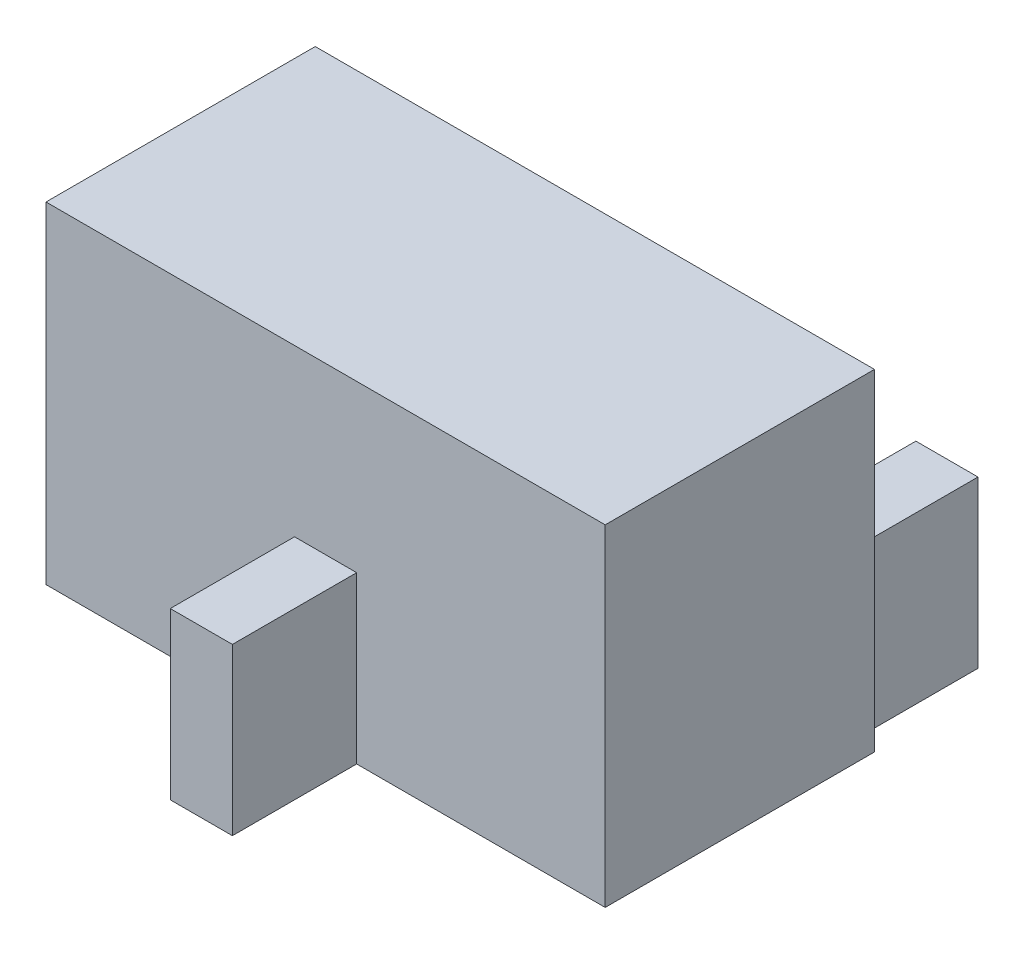
ISO-10303-21;
HEADER;
FILE_DESCRIPTION(('STEP AP214'),'2;1');
FILE_NAME('part.step','',(''),(''),'','','');
FILE_SCHEMA(('AUTOMOTIVE_DESIGN { 1 0 10303 214 1 1 1 1 }'));
ENDSEC;
DATA;
#1=APPLICATION_CONTEXT('core data for automotive mechanical design processes');
#2=APPLICATION_PROTOCOL_DEFINITION('international standard','automotive_design',2000,#1);
#3=PRODUCT_CONTEXT('',#1,'mechanical');
#4=PRODUCT('Part','Part','',(#3));
#5=PRODUCT_RELATED_PRODUCT_CATEGORY('part','',(#4));
#6=PRODUCT_DEFINITION_FORMATION('','',#4);
#7=PRODUCT_DEFINITION_CONTEXT('part definition',#1,'design');
#8=PRODUCT_DEFINITION('design','',#6,#7);
#9=PRODUCT_DEFINITION_SHAPE('','',#8);
#10=(LENGTH_UNIT() NAMED_UNIT(*) SI_UNIT(.MILLI.,.METRE.));
#11=(NAMED_UNIT(*) PLANE_ANGLE_UNIT() SI_UNIT($,.RADIAN.));
#12=(NAMED_UNIT(*) SI_UNIT($,.STERADIAN.) SOLID_ANGLE_UNIT());
#13=UNCERTAINTY_MEASURE_WITH_UNIT(LENGTH_MEASURE(1.E-05),#10,'distance_accuracy_value','');
#14=(GEOMETRIC_REPRESENTATION_CONTEXT(3) GLOBAL_UNCERTAINTY_ASSIGNED_CONTEXT((#13)) GLOBAL_UNIT_ASSIGNED_CONTEXT((#10,
#11,#12)) REPRESENTATION_CONTEXT('',''));
#15=CARTESIAN_POINT('',(0.,0.,0.));
#16=DIRECTION('',(0.,0.,1.));
#17=DIRECTION('',(1.,0.,0.));
#18=AXIS2_PLACEMENT_3D('',#15,#16,#17);
#19=CARTESIAN_POINT('',(-1.81283783783784,1.6,0.816891891891892));
#20=DIRECTION('',(0.,0.,-1.));
#21=DIRECTION('',(-1.,0.,0.));
#22=AXIS2_PLACEMENT_3D('',#19,#20,#21);
#23=PLANE('',#22);
#24=DIRECTION('',(0.,-1.,0.));
#25=VECTOR('',#24,1.);
#26=CARTESIAN_POINT('',(-0.612837837837838,0.8,0.816891891891892));
#27=LINE('',#26,#25);
#28=CARTESIAN_POINT('',(-0.612837837837838,0.8,0.816891891891892));
#29=VERTEX_POINT('',#28);
#30=CARTESIAN_POINT('',(-0.612837837837838,0.,0.816891891891892));
#31=VERTEX_POINT('',#30);
#32=EDGE_CURVE('E317',#29,#31,#27,.T.);
#33=ORIENTED_EDGE('',*,*,#32,.F.);
#34=DIRECTION('',(-1.,0.,0.));
#35=VECTOR('',#34,1.);
#36=CARTESIAN_POINT('',(-0.312837837837838,0.8,0.816891891891892));
#37=LINE('',#36,#35);
#38=CARTESIAN_POINT('',(-0.312837837837838,0.8,0.816891891891892));
#39=VERTEX_POINT('',#38);
#40=EDGE_CURVE('E171',#39,#29,#37,.T.);
#41=ORIENTED_EDGE('',*,*,#40,.F.);
#42=DIRECTION('',(0.,-1.,0.));
#43=VECTOR('',#42,1.);
#44=CARTESIAN_POINT('',(-0.312837837837838,0.8,0.816891891891892));
#45=LINE('',#44,#43);
#46=CARTESIAN_POINT('',(-0.312837837837838,0.,0.816891891891892));
#47=VERTEX_POINT('',#46);
#48=EDGE_CURVE('E183',#39,#47,#45,.T.);
#49=ORIENTED_EDGE('',*,*,#48,.T.);
#50=DIRECTION('',(1.,0.,0.));
#51=VECTOR('',#50,1.);
#52=CARTESIAN_POINT('',(-1.81283783783784,0.,0.816891891891892));
#53=LINE('',#52,#51);
#54=CARTESIAN_POINT('',(0.887162162162162,0.,0.816891891891892));
#55=VERTEX_POINT('',#54);
#56=EDGE_CURVE('E250',#47,#55,#53,.T.);
#57=ORIENTED_EDGE('',*,*,#56,.T.);
#58=DIRECTION('',(0.,-1.,0.));
#59=VECTOR('',#58,1.);
#60=CARTESIAN_POINT('',(0.887162162162162,1.6,0.816891891891892));
#61=LINE('',#60,#59);
#62=CARTESIAN_POINT('',(0.887162162162162,1.6,0.816891891891892));
#63=VERTEX_POINT('',#62);
#64=EDGE_CURVE('E48',#63,#55,#61,.T.);
#65=ORIENTED_EDGE('',*,*,#64,.F.);
#66=DIRECTION('',(1.,0.,0.));
#67=VECTOR('',#66,1.);
#68=CARTESIAN_POINT('',(-1.81283783783784,1.6,0.816891891891892));
#69=LINE('',#68,#67);
#70=CARTESIAN_POINT('',(-1.81283783783784,1.6,0.816891891891892));
#71=VERTEX_POINT('',#70);
#72=EDGE_CURVE('E240',#71,#63,#69,.T.);
#73=ORIENTED_EDGE('',*,*,#72,.F.);
#74=DIRECTION('',(0.,-1.,0.));
#75=VECTOR('',#74,1.);
#76=CARTESIAN_POINT('',(-1.81283783783784,1.6,0.816891891891892));
#77=LINE('',#76,#75);
#78=CARTESIAN_POINT('',(-1.81283783783784,0.,0.816891891891892));
#79=VERTEX_POINT('',#78);
#80=EDGE_CURVE('E11',#71,#79,#77,.T.);
#81=ORIENTED_EDGE('',*,*,#80,.T.);
#82=EDGE_CURVE('E251',#79,#31,#53,.T.);
#83=ORIENTED_EDGE('',*,*,#82,.T.);
#84=EDGE_LOOP('',(#33,#41,#49,#57,#65,#73,#81,#83));
#85=FACE_BOUND('',#84,.T.);
#86=ADVANCED_FACE('F40',(#85),#23,.F.);
#87=CARTESIAN_POINT('',(-1.81283783783784,1.6,-0.483108108108108));
#88=DIRECTION('',(0.,0.,1.));
#89=DIRECTION('',(1.,0.,0.));
#90=AXIS2_PLACEMENT_3D('',#87,#88,#89);
#91=PLANE('',#90);
#92=DIRECTION('',(0.,-1.,0.));
#93=VECTOR('',#92,1.);
#94=CARTESIAN_POINT('',(0.787162162162162,0.8,-0.483108108108108));
#95=LINE('',#94,#93);
#96=CARTESIAN_POINT('',(0.787162162162162,0.8,-0.483108108108108));
#97=VERTEX_POINT('',#96);
#98=CARTESIAN_POINT('',(0.787162162162161,0.,-0.483108108108108));
#99=VERTEX_POINT('',#98);
#100=EDGE_CURVE('E195',#97,#99,#95,.T.);
#101=ORIENTED_EDGE('',*,*,#100,.F.);
#102=DIRECTION('',(1.,0.,0.));
#103=VECTOR('',#102,1.);
#104=CARTESIAN_POINT('',(0.787162162162162,0.8,-0.483108108108108));
#105=LINE('',#104,#103);
#106=CARTESIAN_POINT('',(0.487162162162162,0.8,-0.483108108108108));
#107=VERTEX_POINT('',#106);
#108=EDGE_CURVE('E63',#107,#97,#105,.T.);
#109=ORIENTED_EDGE('',*,*,#108,.F.);
#110=DIRECTION('',(0.,-1.,0.));
#111=VECTOR('',#110,1.);
#112=CARTESIAN_POINT('',(0.487162162162162,0.8,-0.483108108108108));
#113=LINE('',#112,#111);
#114=CARTESIAN_POINT('',(0.487162162162162,0.,-0.483108108108108));
#115=VERTEX_POINT('',#114);
#116=EDGE_CURVE('E202',#107,#115,#113,.T.);
#117=ORIENTED_EDGE('',*,*,#116,.T.);
#118=DIRECTION('',(-1.,0.,0.));
#119=VECTOR('',#118,1.);
#120=CARTESIAN_POINT('',(-1.81283783783784,0.,-0.483108108108108));
#121=LINE('',#120,#119);
#122=CARTESIAN_POINT('',(-1.41283783783784,0.,-0.483108108108108));
#123=VERTEX_POINT('',#122);
#124=EDGE_CURVE('E258',#115,#123,#121,.T.);
#125=ORIENTED_EDGE('',*,*,#124,.T.);
#126=DIRECTION('',(0.,-1.,0.));
#127=VECTOR('',#126,1.);
#128=CARTESIAN_POINT('',(-1.41283783783784,0.8,-0.483108108108108));
#129=LINE('',#128,#127);
#130=CARTESIAN_POINT('',(-1.41283783783784,0.8,-0.483108108108108));
#131=VERTEX_POINT('',#130);
#132=EDGE_CURVE('E230',#131,#123,#129,.T.);
#133=ORIENTED_EDGE('',*,*,#132,.F.);
#134=DIRECTION('',(1.,0.,0.));
#135=VECTOR('',#134,1.);
#136=CARTESIAN_POINT('',(-1.71283783783784,0.8,-0.483108108108108));
#137=LINE('',#136,#135);
#138=CARTESIAN_POINT('',(-1.71283783783784,0.8,-0.483108108108108));
#139=VERTEX_POINT('',#138);
#140=EDGE_CURVE('E213',#139,#131,#137,.T.);
#141=ORIENTED_EDGE('',*,*,#140,.F.);
#142=DIRECTION('',(0.,-1.,0.));
#143=VECTOR('',#142,1.);
#144=CARTESIAN_POINT('',(-1.71283783783784,0.8,-0.483108108108108));
#145=LINE('',#144,#143);
#146=CARTESIAN_POINT('',(-1.71283783783784,0.,-0.483108108108108));
#147=VERTEX_POINT('',#146);
#148=EDGE_CURVE('E233',#139,#147,#145,.T.);
#149=ORIENTED_EDGE('',*,*,#148,.T.);
#150=CARTESIAN_POINT('',(-1.81283783783784,0.,-0.483108108108108));
#151=VERTEX_POINT('',#150);
#152=EDGE_CURVE('E256',#147,#151,#121,.T.);
#153=ORIENTED_EDGE('',*,*,#152,.T.);
#154=DIRECTION('',(0.,-1.,0.));
#155=VECTOR('',#154,1.);
#156=CARTESIAN_POINT('',(-1.81283783783784,1.6,-0.483108108108108));
#157=LINE('',#156,#155);
#158=CARTESIAN_POINT('',(-1.81283783783784,1.6,-0.483108108108108));
#159=VERTEX_POINT('',#158);
#160=EDGE_CURVE('E247',#159,#151,#157,.T.);
#161=ORIENTED_EDGE('',*,*,#160,.F.);
#162=DIRECTION('',(-1.,0.,0.));
#163=VECTOR('',#162,1.);
#164=CARTESIAN_POINT('',(-1.81283783783784,1.6,-0.483108108108108));
#165=LINE('',#164,#163);
#166=CARTESIAN_POINT('',(0.887162162162162,1.6,-0.483108108108108));
#167=VERTEX_POINT('',#166);
#168=EDGE_CURVE('E245',#167,#159,#165,.T.);
#169=ORIENTED_EDGE('',*,*,#168,.F.);
#170=DIRECTION('',(0.,-1.,0.));
#171=VECTOR('',#170,1.);
#172=CARTESIAN_POINT('',(0.887162162162162,1.6,-0.483108108108108));
#173=LINE('',#172,#171);
#174=CARTESIAN_POINT('',(0.887162162162162,0.,-0.483108108108108));
#175=VERTEX_POINT('',#174);
#176=EDGE_CURVE('E261',#167,#175,#173,.T.);
#177=ORIENTED_EDGE('',*,*,#176,.T.);
#178=EDGE_CURVE('E241',#175,#99,#121,.T.);
#179=ORIENTED_EDGE('',*,*,#178,.T.);
#180=EDGE_LOOP('',(#101,#109,#117,#125,#133,#141,#149,#153,#161,#169,#177,#179));
#181=FACE_BOUND('',#180,.T.);
#182=ADVANCED_FACE('F277',(#181),#91,.F.);
#183=CARTESIAN_POINT('',(-1.81283783783784,1.6,-0.483108108108108));
#184=DIRECTION('',(1.,0.,0.));
#185=DIRECTION('',(0.,0.,-1.));
#186=AXIS2_PLACEMENT_3D('',#183,#184,#185);
#187=PLANE('',#186);
#188=DIRECTION('',(0.,0.,1.));
#189=VECTOR('',#188,1.);
#190=CARTESIAN_POINT('',(-1.81283783783784,0.,-0.483108108108108));
#191=LINE('',#190,#189);
#192=EDGE_CURVE('E236',#151,#79,#191,.T.);
#193=ORIENTED_EDGE('',*,*,#192,.T.);
#194=ORIENTED_EDGE('',*,*,#80,.F.);
#195=DIRECTION('',(0.,0.,1.));
#196=VECTOR('',#195,1.);
#197=CARTESIAN_POINT('',(-1.81283783783784,1.6,-0.483108108108108));
#198=LINE('',#197,#196);
#199=EDGE_CURVE('E237',#159,#71,#198,.T.);
#200=ORIENTED_EDGE('',*,*,#199,.F.);
#201=ORIENTED_EDGE('',*,*,#160,.T.);
#202=EDGE_LOOP('',(#193,#194,#200,#201));
#203=FACE_BOUND('',#202,.T.);
#204=ADVANCED_FACE('F42',(#203),#187,.F.);
#205=CARTESIAN_POINT('',(0.887162162162162,1.6,-0.483108108108108));
#206=DIRECTION('',(-1.,0.,0.));
#207=DIRECTION('',(0.,0.,1.));
#208=AXIS2_PLACEMENT_3D('',#205,#206,#207);
#209=PLANE('',#208);
#210=DIRECTION('',(0.,0.,-1.));
#211=VECTOR('',#210,1.);
#212=CARTESIAN_POINT('',(0.887162162162162,0.,-0.483108108108108));
#213=LINE('',#212,#211);
#214=EDGE_CURVE('E254',#55,#175,#213,.T.);
#215=ORIENTED_EDGE('',*,*,#214,.T.);
#216=ORIENTED_EDGE('',*,*,#176,.F.);
#217=DIRECTION('',(0.,0.,-1.));
#218=VECTOR('',#217,1.);
#219=CARTESIAN_POINT('',(0.887162162162162,1.6,-0.483108108108108));
#220=LINE('',#219,#218);
#221=EDGE_CURVE('E243',#63,#167,#220,.T.);
#222=ORIENTED_EDGE('',*,*,#221,.F.);
#223=ORIENTED_EDGE('',*,*,#64,.T.);
#224=EDGE_LOOP('',(#215,#216,#222,#223));
#225=FACE_BOUND('',#224,.T.);
#226=ADVANCED_FACE('F268',(#225),#209,.F.);
#227=CARTESIAN_POINT('',(0.,1.6,0.));
#228=DIRECTION('',(0.,1.,0.));
#229=DIRECTION('',(0.,0.,1.));
#230=AXIS2_PLACEMENT_3D('',#227,#228,#229);
#231=PLANE('',#230);
#232=ORIENTED_EDGE('',*,*,#199,.T.);
#233=ORIENTED_EDGE('',*,*,#72,.T.);
#234=ORIENTED_EDGE('',*,*,#221,.T.);
#235=ORIENTED_EDGE('',*,*,#168,.T.);
#236=EDGE_LOOP('',(#232,#233,#234,#235));
#237=FACE_BOUND('',#236,.T.);
#238=ADVANCED_FACE('F316',(#237),#231,.T.);
#239=CARTESIAN_POINT('',(0.,0.,0.));
#240=DIRECTION('',(0.,1.,0.));
#241=DIRECTION('',(0.,0.,1.));
#242=AXIS2_PLACEMENT_3D('',#239,#240,#241);
#243=PLANE('',#242);
#244=ORIENTED_EDGE('',*,*,#192,.F.);
#245=ORIENTED_EDGE('',*,*,#152,.F.);
#246=DIRECTION('',(0.,0.,1.));
#247=VECTOR('',#246,1.);
#248=CARTESIAN_POINT('',(-1.71283783783784,0.,-0.483108108108108));
#249=LINE('',#248,#247);
#250=CARTESIAN_POINT('',(-1.71283783783784,0.,-1.08310810810811));
#251=VERTEX_POINT('',#250);
#252=EDGE_CURVE('E210',#251,#147,#249,.T.);
#253=ORIENTED_EDGE('',*,*,#252,.F.);
#254=DIRECTION('',(-1.,0.,0.));
#255=VECTOR('',#254,1.);
#256=CARTESIAN_POINT('',(-1.71283783783784,0.,-1.08310810810811));
#257=LINE('',#256,#255);
#258=CARTESIAN_POINT('',(-1.41283783783784,0.,-1.08310810810811));
#259=VERTEX_POINT('',#258);
#260=EDGE_CURVE('E214',#259,#251,#257,.T.);
#261=ORIENTED_EDGE('',*,*,#260,.F.);
#262=DIRECTION('',(0.,0.,-1.));
#263=VECTOR('',#262,1.);
#264=CARTESIAN_POINT('',(-1.41283783783784,0.,-0.483108108108108));
#265=LINE('',#264,#263);
#266=EDGE_CURVE('E222',#123,#259,#265,.T.);
#267=ORIENTED_EDGE('',*,*,#266,.F.);
#268=ORIENTED_EDGE('',*,*,#124,.F.);
#269=DIRECTION('',(0.,0.,1.));
#270=VECTOR('',#269,1.);
#271=CARTESIAN_POINT('',(0.487162162162162,0.,-0.483108108108108));
#272=LINE('',#271,#270);
#273=CARTESIAN_POINT('',(0.487162162162162,0.,-1.08310810810811));
#274=VERTEX_POINT('',#273);
#275=EDGE_CURVE('E191',#274,#115,#272,.T.);
#276=ORIENTED_EDGE('',*,*,#275,.F.);
#277=DIRECTION('',(-1.,0.,0.));
#278=VECTOR('',#277,1.);
#279=CARTESIAN_POINT('',(0.787162162162162,0.,-1.08310810810811));
#280=LINE('',#279,#278);
#281=CARTESIAN_POINT('',(0.787162162162162,0.,-1.08310810810811));
#282=VERTEX_POINT('',#281);
#283=EDGE_CURVE('E181',#282,#274,#280,.T.);
#284=ORIENTED_EDGE('',*,*,#283,.F.);
#285=DIRECTION('',(0.,0.,-1.));
#286=VECTOR('',#285,1.);
#287=CARTESIAN_POINT('',(0.787162162162162,0.,-0.483108108108108));
#288=LINE('',#287,#286);
#289=EDGE_CURVE('E178',#99,#282,#288,.T.);
#290=ORIENTED_EDGE('',*,*,#289,.F.);
#291=ORIENTED_EDGE('',*,*,#178,.F.);
#292=ORIENTED_EDGE('',*,*,#214,.F.);
#293=ORIENTED_EDGE('',*,*,#56,.F.);
#294=DIRECTION('',(0.,0.,-1.));
#295=VECTOR('',#294,1.);
#296=CARTESIAN_POINT('',(-0.312837837837838,0.,1.41689189189189));
#297=LINE('',#296,#295);
#298=CARTESIAN_POINT('',(-0.312837837837838,0.,1.41689189189189));
#299=VERTEX_POINT('',#298);
#300=EDGE_CURVE('E55',#299,#47,#297,.T.);
#301=ORIENTED_EDGE('',*,*,#300,.F.);
#302=DIRECTION('',(1.,0.,0.));
#303=VECTOR('',#302,1.);
#304=CARTESIAN_POINT('',(-0.312837837837838,0.,1.41689189189189));
#305=LINE('',#304,#303);
#306=CARTESIAN_POINT('',(-0.612837837837838,0.,1.41689189189189));
#307=VERTEX_POINT('',#306);
#308=EDGE_CURVE('E322',#307,#299,#305,.T.);
#309=ORIENTED_EDGE('',*,*,#308,.F.);
#310=DIRECTION('',(0.,0.,1.));
#311=VECTOR('',#310,1.);
#312=CARTESIAN_POINT('',(-0.612837837837838,0.,1.41689189189189));
#313=LINE('',#312,#311);
#314=EDGE_CURVE('E177',#31,#307,#313,.T.);
#315=ORIENTED_EDGE('',*,*,#314,.F.);
#316=ORIENTED_EDGE('',*,*,#82,.F.);
#317=EDGE_LOOP('',(#244,#245,#253,#261,#267,#268,#276,#284,#290,#291,#292,#293,#301,#309,#315,#316));
#318=FACE_BOUND('',#317,.T.);
#319=ADVANCED_FACE('F275',(#318),#243,.F.);
#320=CARTESIAN_POINT('',(-1.71283783783784,0.8,-0.483108108108108));
#321=DIRECTION('',(1.,0.,0.));
#322=DIRECTION('',(0.,0.,-1.));
#323=AXIS2_PLACEMENT_3D('',#320,#321,#322);
#324=PLANE('',#323);
#325=ORIENTED_EDGE('',*,*,#252,.T.);
#326=ORIENTED_EDGE('',*,*,#148,.F.);
#327=DIRECTION('',(0.,0.,1.));
#328=VECTOR('',#327,1.);
#329=CARTESIAN_POINT('',(-1.71283783783784,0.8,-0.483108108108108));
#330=LINE('',#329,#328);
#331=CARTESIAN_POINT('',(-1.71283783783784,0.8,-1.08310810810811));
#332=VERTEX_POINT('',#331);
#333=EDGE_CURVE('E211',#332,#139,#330,.T.);
#334=ORIENTED_EDGE('',*,*,#333,.F.);
#335=DIRECTION('',(0.,-1.,0.));
#336=VECTOR('',#335,1.);
#337=CARTESIAN_POINT('',(-1.71283783783784,0.8,-1.08310810810811));
#338=LINE('',#337,#336);
#339=EDGE_CURVE('E220',#332,#251,#338,.T.);
#340=ORIENTED_EDGE('',*,*,#339,.T.);
#341=EDGE_LOOP('',(#325,#326,#334,#340));
#342=FACE_BOUND('',#341,.T.);
#343=ADVANCED_FACE('F307',(#342),#324,.F.);
#344=CARTESIAN_POINT('',(-1.41283783783784,0.8,-0.483108108108108));
#345=DIRECTION('',(-1.,0.,0.));
#346=DIRECTION('',(0.,0.,1.));
#347=AXIS2_PLACEMENT_3D('',#344,#345,#346);
#348=PLANE('',#347);
#349=ORIENTED_EDGE('',*,*,#266,.T.);
#350=DIRECTION('',(0.,-1.,0.));
#351=VECTOR('',#350,1.);
#352=CARTESIAN_POINT('',(-1.41283783783784,0.8,-1.08310810810811));
#353=LINE('',#352,#351);
#354=CARTESIAN_POINT('',(-1.41283783783784,0.8,-1.08310810810811));
#355=VERTEX_POINT('',#354);
#356=EDGE_CURVE('E227',#355,#259,#353,.T.);
#357=ORIENTED_EDGE('',*,*,#356,.F.);
#358=DIRECTION('',(0.,0.,-1.));
#359=VECTOR('',#358,1.);
#360=CARTESIAN_POINT('',(-1.41283783783784,0.8,-0.483108108108108));
#361=LINE('',#360,#359);
#362=EDGE_CURVE('E216',#131,#355,#361,.T.);
#363=ORIENTED_EDGE('',*,*,#362,.F.);
#364=ORIENTED_EDGE('',*,*,#132,.T.);
#365=EDGE_LOOP('',(#349,#357,#363,#364));
#366=FACE_BOUND('',#365,.T.);
#367=ADVANCED_FACE('F296',(#366),#348,.F.);
#368=CARTESIAN_POINT('',(-1.71283783783784,0.8,-1.08310810810811));
#369=DIRECTION('',(0.,0.,1.));
#370=DIRECTION('',(1.,0.,0.));
#371=AXIS2_PLACEMENT_3D('',#368,#369,#370);
#372=PLANE('',#371);
#373=ORIENTED_EDGE('',*,*,#260,.T.);
#374=ORIENTED_EDGE('',*,*,#339,.F.);
#375=DIRECTION('',(-1.,0.,0.));
#376=VECTOR('',#375,1.);
#377=CARTESIAN_POINT('',(-1.71283783783784,0.8,-1.08310810810811));
#378=LINE('',#377,#376);
#379=EDGE_CURVE('E218',#355,#332,#378,.T.);
#380=ORIENTED_EDGE('',*,*,#379,.F.);
#381=ORIENTED_EDGE('',*,*,#356,.T.);
#382=EDGE_LOOP('',(#373,#374,#380,#381));
#383=FACE_BOUND('',#382,.T.);
#384=ADVANCED_FACE('F303',(#383),#372,.F.);
#385=CARTESIAN_POINT('',(0.,0.8,0.));
#386=DIRECTION('',(0.,-1.,0.));
#387=DIRECTION('',(0.,0.,-1.));
#388=AXIS2_PLACEMENT_3D('',#385,#386,#387);
#389=PLANE('',#388);
#390=ORIENTED_EDGE('',*,*,#333,.T.);
#391=ORIENTED_EDGE('',*,*,#140,.T.);
#392=ORIENTED_EDGE('',*,*,#362,.T.);
#393=ORIENTED_EDGE('',*,*,#379,.T.);
#394=EDGE_LOOP('',(#390,#391,#392,#393));
#395=FACE_BOUND('',#394,.T.);
#396=ADVANCED_FACE('F310',(#395),#389,.F.);
#397=CARTESIAN_POINT('',(0.787162162162162,0.8,-0.483108108108108));
#398=DIRECTION('',(-1.,0.,0.));
#399=DIRECTION('',(0.,0.,1.));
#400=AXIS2_PLACEMENT_3D('',#397,#398,#399);
#401=PLANE('',#400);
#402=ORIENTED_EDGE('',*,*,#289,.T.);
#403=DIRECTION('',(0.,-1.,0.));
#404=VECTOR('',#403,1.);
#405=CARTESIAN_POINT('',(0.787162162162162,0.8,-1.08310810810811));
#406=LINE('',#405,#404);
#407=CARTESIAN_POINT('',(0.787162162162162,0.8,-1.08310810810811));
#408=VERTEX_POINT('',#407);
#409=EDGE_CURVE('E207',#408,#282,#406,.T.);
#410=ORIENTED_EDGE('',*,*,#409,.F.);
#411=DIRECTION('',(0.,0.,-1.));
#412=VECTOR('',#411,1.);
#413=CARTESIAN_POINT('',(0.787162162162162,0.8,-0.483108108108108));
#414=LINE('',#413,#412);
#415=EDGE_CURVE('E187',#97,#408,#414,.T.);
#416=ORIENTED_EDGE('',*,*,#415,.F.);
#417=ORIENTED_EDGE('',*,*,#100,.T.);
#418=EDGE_LOOP('',(#402,#410,#416,#417));
#419=FACE_BOUND('',#418,.T.);
#420=ADVANCED_FACE('F281',(#419),#401,.F.);
#421=CARTESIAN_POINT('',(0.787162162162162,0.8,-1.08310810810811));
#422=DIRECTION('',(0.,0.,1.));
#423=DIRECTION('',(1.,0.,0.));
#424=AXIS2_PLACEMENT_3D('',#421,#422,#423);
#425=PLANE('',#424);
#426=ORIENTED_EDGE('',*,*,#283,.T.);
#427=DIRECTION('',(0.,-1.,0.));
#428=VECTOR('',#427,1.);
#429=CARTESIAN_POINT('',(0.487162162162162,0.8,-1.08310810810811));
#430=LINE('',#429,#428);
#431=CARTESIAN_POINT('',(0.487162162162162,0.8,-1.08310810810811));
#432=VERTEX_POINT('',#431);
#433=EDGE_CURVE('E204',#432,#274,#430,.T.);
#434=ORIENTED_EDGE('',*,*,#433,.F.);
#435=DIRECTION('',(-1.,0.,0.));
#436=VECTOR('',#435,1.);
#437=CARTESIAN_POINT('',(0.787162162162162,0.8,-1.08310810810811));
#438=LINE('',#437,#436);
#439=EDGE_CURVE('E190',#408,#432,#438,.T.);
#440=ORIENTED_EDGE('',*,*,#439,.F.);
#441=ORIENTED_EDGE('',*,*,#409,.T.);
#442=EDGE_LOOP('',(#426,#434,#440,#441));
#443=FACE_BOUND('',#442,.T.);
#444=ADVANCED_FACE('F356',(#443),#425,.F.);
#445=CARTESIAN_POINT('',(0.487162162162162,0.8,-0.483108108108108));
#446=DIRECTION('',(1.,0.,0.));
#447=DIRECTION('',(0.,0.,-1.));
#448=AXIS2_PLACEMENT_3D('',#445,#446,#447);
#449=PLANE('',#448);
#450=ORIENTED_EDGE('',*,*,#275,.T.);
#451=ORIENTED_EDGE('',*,*,#116,.F.);
#452=DIRECTION('',(0.,0.,1.));
#453=VECTOR('',#452,1.);
#454=CARTESIAN_POINT('',(0.487162162162162,0.8,-0.483108108108108));
#455=LINE('',#454,#453);
#456=EDGE_CURVE('E193',#432,#107,#455,.T.);
#457=ORIENTED_EDGE('',*,*,#456,.F.);
#458=ORIENTED_EDGE('',*,*,#433,.T.);
#459=EDGE_LOOP('',(#450,#451,#457,#458));
#460=FACE_BOUND('',#459,.T.);
#461=ADVANCED_FACE('F289',(#460),#449,.F.);
#462=CARTESIAN_POINT('',(0.,0.8,0.));
#463=DIRECTION('',(0.,1.,0.));
#464=DIRECTION('',(0.,0.,1.));
#465=AXIS2_PLACEMENT_3D('',#462,#463,#464);
#466=PLANE('',#465);
#467=ORIENTED_EDGE('',*,*,#415,.T.);
#468=ORIENTED_EDGE('',*,*,#439,.T.);
#469=ORIENTED_EDGE('',*,*,#456,.T.);
#470=ORIENTED_EDGE('',*,*,#108,.T.);
#471=EDGE_LOOP('',(#467,#468,#469,#470));
#472=FACE_BOUND('',#471,.T.);
#473=ADVANCED_FACE('F284',(#472),#466,.T.);
#474=CARTESIAN_POINT('',(-0.612837837837838,0.8,1.41689189189189));
#475=DIRECTION('',(1.,0.,0.));
#476=DIRECTION('',(0.,0.,-1.));
#477=AXIS2_PLACEMENT_3D('',#474,#475,#476);
#478=PLANE('',#477);
#479=ORIENTED_EDGE('',*,*,#314,.T.);
#480=DIRECTION('',(0.,-1.,0.));
#481=VECTOR('',#480,1.);
#482=CARTESIAN_POINT('',(-0.612837837837838,0.8,1.41689189189189));
#483=LINE('',#482,#481);
#484=CARTESIAN_POINT('',(-0.612837837837838,0.8,1.41689189189189));
#485=VERTEX_POINT('',#484);
#486=EDGE_CURVE('E160',#485,#307,#483,.T.);
#487=ORIENTED_EDGE('',*,*,#486,.F.);
#488=DIRECTION('',(0.,0.,1.));
#489=VECTOR('',#488,1.);
#490=CARTESIAN_POINT('',(-0.612837837837838,0.8,1.41689189189189));
#491=LINE('',#490,#489);
#492=EDGE_CURVE('E166',#29,#485,#491,.T.);
#493=ORIENTED_EDGE('',*,*,#492,.F.);
#494=ORIENTED_EDGE('',*,*,#32,.T.);
#495=EDGE_LOOP('',(#479,#487,#493,#494));
#496=FACE_BOUND('',#495,.T.);
#497=ADVANCED_FACE('F175',(#496),#478,.F.);
#498=CARTESIAN_POINT('',(-0.312837837837838,0.8,1.41689189189189));
#499=DIRECTION('',(0.,0.,-1.));
#500=DIRECTION('',(-1.,0.,0.));
#501=AXIS2_PLACEMENT_3D('',#498,#499,#500);
#502=PLANE('',#501);
#503=ORIENTED_EDGE('',*,*,#308,.T.);
#504=DIRECTION('',(0.,-1.,0.));
#505=VECTOR('',#504,1.);
#506=CARTESIAN_POINT('',(-0.312837837837838,0.8,1.41689189189189));
#507=LINE('',#506,#505);
#508=CARTESIAN_POINT('',(-0.312837837837838,0.8,1.41689189189189));
#509=VERTEX_POINT('',#508);
#510=EDGE_CURVE('E162',#509,#299,#507,.T.);
#511=ORIENTED_EDGE('',*,*,#510,.F.);
#512=DIRECTION('',(1.,0.,0.));
#513=VECTOR('',#512,1.);
#514=CARTESIAN_POINT('',(-0.312837837837838,0.8,1.41689189189189));
#515=LINE('',#514,#513);
#516=EDGE_CURVE('E156',#485,#509,#515,.T.);
#517=ORIENTED_EDGE('',*,*,#516,.F.);
#518=ORIENTED_EDGE('',*,*,#486,.T.);
#519=EDGE_LOOP('',(#503,#511,#517,#518));
#520=FACE_BOUND('',#519,.T.);
#521=ADVANCED_FACE('F158',(#520),#502,.F.);
#522=CARTESIAN_POINT('',(-0.312837837837838,0.8,1.41689189189189));
#523=DIRECTION('',(-1.,0.,0.));
#524=DIRECTION('',(0.,0.,1.));
#525=AXIS2_PLACEMENT_3D('',#522,#523,#524);
#526=PLANE('',#525);
#527=ORIENTED_EDGE('',*,*,#300,.T.);
#528=ORIENTED_EDGE('',*,*,#48,.F.);
#529=DIRECTION('',(0.,0.,-1.));
#530=VECTOR('',#529,1.);
#531=CARTESIAN_POINT('',(-0.312837837837838,0.8,1.41689189189189));
#532=LINE('',#531,#530);
#533=EDGE_CURVE('E165',#509,#39,#532,.T.);
#534=ORIENTED_EDGE('',*,*,#533,.F.);
#535=ORIENTED_EDGE('',*,*,#510,.T.);
#536=EDGE_LOOP('',(#527,#528,#534,#535));
#537=FACE_BOUND('',#536,.T.);
#538=ADVANCED_FACE('F325',(#537),#526,.F.);
#539=CARTESIAN_POINT('',(0.,0.8,0.));
#540=DIRECTION('',(0.,1.,0.));
#541=DIRECTION('',(0.,0.,1.));
#542=AXIS2_PLACEMENT_3D('',#539,#540,#541);
#543=PLANE('',#542);
#544=ORIENTED_EDGE('',*,*,#492,.T.);
#545=ORIENTED_EDGE('',*,*,#516,.T.);
#546=ORIENTED_EDGE('',*,*,#533,.T.);
#547=ORIENTED_EDGE('',*,*,#40,.T.);
#548=EDGE_LOOP('',(#544,#545,#546,#547));
#549=FACE_BOUND('',#548,.T.);
#550=ADVANCED_FACE('F169',(#549),#543,.T.);
#551=CLOSED_SHELL('',(#86,#182,#204,#226,#238,#319,#343,#367,#384,#396,#420,#444,#461,#473,#497,
#521,#538,#550));
#552=MANIFOLD_SOLID_BREP('B2',#551);
#553=ADVANCED_BREP_SHAPE_REPRESENTATION('',(#18,#552),#14);
#554=SHAPE_DEFINITION_REPRESENTATION(#9,#553);
ENDSEC;
END-ISO-10303-21;
